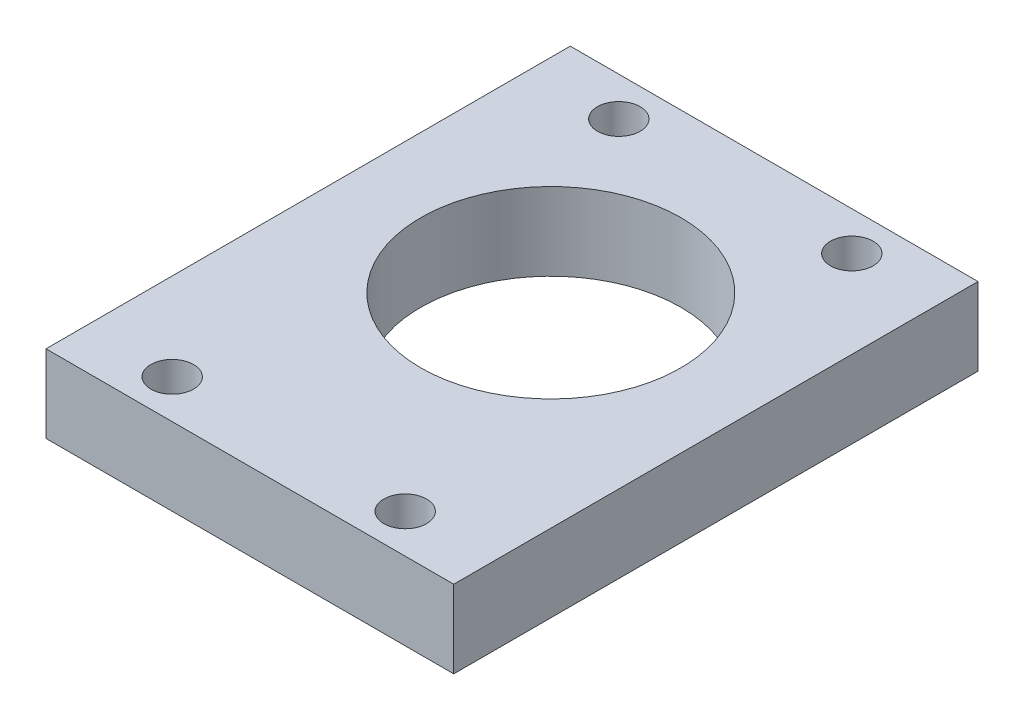
ISO-10303-21;
HEADER;
FILE_DESCRIPTION(('STEP AP214'),'2;1');
FILE_NAME('part.step','',(''),(''),'','','');
FILE_SCHEMA(('AUTOMOTIVE_DESIGN { 1 0 10303 214 1 1 1 1 }'));
ENDSEC;
DATA;
#1=APPLICATION_CONTEXT('core data for automotive mechanical design processes');
#2=APPLICATION_PROTOCOL_DEFINITION('international standard','automotive_design',2000,#1);
#3=PRODUCT_CONTEXT('',#1,'mechanical');
#4=PRODUCT('Part','Part','',(#3));
#5=PRODUCT_RELATED_PRODUCT_CATEGORY('part','',(#4));
#6=PRODUCT_DEFINITION_FORMATION('','',#4);
#7=PRODUCT_DEFINITION_CONTEXT('part definition',#1,'design');
#8=PRODUCT_DEFINITION('design','',#6,#7);
#9=PRODUCT_DEFINITION_SHAPE('','',#8);
#10=(LENGTH_UNIT() NAMED_UNIT(*) SI_UNIT(.MILLI.,.METRE.));
#11=(NAMED_UNIT(*) PLANE_ANGLE_UNIT() SI_UNIT($,.RADIAN.));
#12=(NAMED_UNIT(*) SI_UNIT($,.STERADIAN.) SOLID_ANGLE_UNIT());
#13=UNCERTAINTY_MEASURE_WITH_UNIT(LENGTH_MEASURE(1.E-05),#10,'distance_accuracy_value','');
#14=(GEOMETRIC_REPRESENTATION_CONTEXT(3) GLOBAL_UNCERTAINTY_ASSIGNED_CONTEXT((#13)) GLOBAL_UNIT_ASSIGNED_CONTEXT((#10,
#11,#12)) REPRESENTATION_CONTEXT('',''));
#15=CARTESIAN_POINT('',(0.,0.,0.));
#16=DIRECTION('',(0.,0.,1.));
#17=DIRECTION('',(1.,0.,0.));
#18=AXIS2_PLACEMENT_3D('',#15,#16,#17);
#19=CARTESIAN_POINT('',(0.,8.,0.));
#20=DIRECTION('',(0.,-1.,0.));
#21=DIRECTION('',(0.,0.,-1.));
#22=AXIS2_PLACEMENT_3D('',#19,#20,#21);
#23=PLANE('',#22);
#24=CARTESIAN_POINT('',(9.,8.,-4.));
#25=DIRECTION('',(0.,1.,0.));
#26=DIRECTION('',(0.,0.,-1.));
#27=AXIS2_PLACEMENT_3D('',#24,#25,#26);
#28=CIRCLE('',#27,2.2);
#29=CARTESIAN_POINT('',(9.,8.,-6.2));
#30=VERTEX_POINT('',#29);
#31=EDGE_CURVE('E123',#30,#30,#28,.T.);
#32=ORIENTED_EDGE('',*,*,#31,.F.);
#33=EDGE_LOOP('',(#32));
#34=FACE_BOUND('',#33,.T.);
#35=CARTESIAN_POINT('',(33.,8.,-4.));
#36=DIRECTION('',(0.,1.,0.));
#37=DIRECTION('',(0.,0.,-1.));
#38=AXIS2_PLACEMENT_3D('',#35,#36,#37);
#39=CIRCLE('',#38,2.2);
#40=CARTESIAN_POINT('',(33.,8.,-6.2));
#41=VERTEX_POINT('',#40);
#42=EDGE_CURVE('E129',#41,#41,#39,.T.);
#43=ORIENTED_EDGE('',*,*,#42,.F.);
#44=EDGE_LOOP('',(#43));
#45=FACE_BOUND('',#44,.T.);
#46=CARTESIAN_POINT('',(33.,8.,-50.));
#47=DIRECTION('',(0.,1.,0.));
#48=DIRECTION('',(0.,0.,1.));
#49=AXIS2_PLACEMENT_3D('',#46,#47,#48);
#50=CIRCLE('',#49,2.2);
#51=CARTESIAN_POINT('',(33.,8.,-47.8));
#52=VERTEX_POINT('',#51);
#53=EDGE_CURVE('E135',#52,#52,#50,.T.);
#54=ORIENTED_EDGE('',*,*,#53,.F.);
#55=EDGE_LOOP('',(#54));
#56=FACE_BOUND('',#55,.T.);
#57=CARTESIAN_POINT('',(9.,8.,-50.));
#58=DIRECTION('',(0.,1.,0.));
#59=DIRECTION('',(0.,0.,1.));
#60=AXIS2_PLACEMENT_3D('',#57,#58,#59);
#61=CIRCLE('',#60,2.2);
#62=CARTESIAN_POINT('',(9.,8.,-47.8));
#63=VERTEX_POINT('',#62);
#64=EDGE_CURVE('E117',#63,#63,#61,.T.);
#65=ORIENTED_EDGE('',*,*,#64,.F.);
#66=EDGE_LOOP('',(#65));
#67=FACE_BOUND('',#66,.T.);
#68=DIRECTION('',(0.,0.,-1.));
#69=VECTOR('',#68,1.);
#70=CARTESIAN_POINT('',(42.,8.,0.));
#71=LINE('',#70,#69);
#72=CARTESIAN_POINT('',(42.,8.,0.));
#73=VERTEX_POINT('',#72);
#74=CARTESIAN_POINT('',(42.,8.,-54.));
#75=VERTEX_POINT('',#74);
#76=EDGE_CURVE('E91',#73,#75,#71,.T.);
#77=ORIENTED_EDGE('',*,*,#76,.T.);
#78=DIRECTION('',(1.,0.,0.));
#79=VECTOR('',#78,1.);
#80=CARTESIAN_POINT('',(0.,8.,-54.));
#81=LINE('',#80,#79);
#82=CARTESIAN_POINT('',(0.,8.,-54.));
#83=VERTEX_POINT('',#82);
#84=EDGE_CURVE('E56',#83,#75,#81,.T.);
#85=ORIENTED_EDGE('',*,*,#84,.F.);
#86=DIRECTION('',(0.,0.,1.));
#87=VECTOR('',#86,1.);
#88=CARTESIAN_POINT('',(0.,8.,0.));
#89=LINE('',#88,#87);
#90=CARTESIAN_POINT('',(0.,8.,0.));
#91=VERTEX_POINT('',#90);
#92=EDGE_CURVE('E97',#83,#91,#89,.T.);
#93=ORIENTED_EDGE('',*,*,#92,.T.);
#94=DIRECTION('',(1.,0.,0.));
#95=VECTOR('',#94,1.);
#96=CARTESIAN_POINT('',(0.,8.,0.));
#97=LINE('',#96,#95);
#98=EDGE_CURVE('E65',#91,#73,#97,.T.);
#99=ORIENTED_EDGE('',*,*,#98,.T.);
#100=EDGE_LOOP('',(#77,#85,#93,#99));
#101=FACE_BOUND('',#100,.T.);
#102=CARTESIAN_POINT('',(21.,8.,-31.));
#103=DIRECTION('',(0.,1.,0.));
#104=DIRECTION('',(0.,0.,1.));
#105=AXIS2_PLACEMENT_3D('',#102,#103,#104);
#106=CIRCLE('',#105,13.4);
#107=CARTESIAN_POINT('',(21.,8.,-17.6));
#108=VERTEX_POINT('',#107);
#109=EDGE_CURVE('E102',#108,#108,#106,.T.);
#110=ORIENTED_EDGE('',*,*,#109,.F.);
#111=EDGE_LOOP('',(#110));
#112=FACE_BOUND('',#111,.T.);
#113=ADVANCED_FACE('F41',(#34,#45,#56,#67,#101,#112),#23,.F.);
#114=CARTESIAN_POINT('',(0.,0.,0.));
#115=DIRECTION('',(0.,-1.,0.));
#116=DIRECTION('',(0.,0.,-1.));
#117=AXIS2_PLACEMENT_3D('',#114,#115,#116);
#118=PLANE('',#117);
#119=CARTESIAN_POINT('',(9.,0.,-4.));
#120=DIRECTION('',(0.,1.,0.));
#121=DIRECTION('',(0.,0.,-1.));
#122=AXIS2_PLACEMENT_3D('',#119,#120,#121);
#123=CIRCLE('',#122,2.2);
#124=CARTESIAN_POINT('',(9.,0.,-6.2));
#125=VERTEX_POINT('',#124);
#126=EDGE_CURVE('E126',#125,#125,#123,.T.);
#127=ORIENTED_EDGE('',*,*,#126,.T.);
#128=EDGE_LOOP('',(#127));
#129=FACE_BOUND('',#128,.T.);
#130=CARTESIAN_POINT('',(33.,0.,-4.));
#131=DIRECTION('',(0.,1.,0.));
#132=DIRECTION('',(0.,0.,-1.));
#133=AXIS2_PLACEMENT_3D('',#130,#131,#132);
#134=CIRCLE('',#133,2.2);
#135=CARTESIAN_POINT('',(33.,0.,-6.2));
#136=VERTEX_POINT('',#135);
#137=EDGE_CURVE('E132',#136,#136,#134,.T.);
#138=ORIENTED_EDGE('',*,*,#137,.T.);
#139=EDGE_LOOP('',(#138));
#140=FACE_BOUND('',#139,.T.);
#141=CARTESIAN_POINT('',(33.,0.,-50.));
#142=DIRECTION('',(0.,1.,0.));
#143=DIRECTION('',(0.,0.,1.));
#144=AXIS2_PLACEMENT_3D('',#141,#142,#143);
#145=CIRCLE('',#144,2.2);
#146=CARTESIAN_POINT('',(33.,0.,-47.8));
#147=VERTEX_POINT('',#146);
#148=EDGE_CURVE('E120',#147,#147,#145,.T.);
#149=ORIENTED_EDGE('',*,*,#148,.T.);
#150=EDGE_LOOP('',(#149));
#151=FACE_BOUND('',#150,.T.);
#152=CARTESIAN_POINT('',(9.,0.,-50.));
#153=DIRECTION('',(0.,1.,0.));
#154=DIRECTION('',(0.,0.,1.));
#155=AXIS2_PLACEMENT_3D('',#152,#153,#154);
#156=CIRCLE('',#155,2.2);
#157=CARTESIAN_POINT('',(9.,0.,-47.8));
#158=VERTEX_POINT('',#157);
#159=EDGE_CURVE('E116',#158,#158,#156,.T.);
#160=ORIENTED_EDGE('',*,*,#159,.T.);
#161=EDGE_LOOP('',(#160));
#162=FACE_BOUND('',#161,.T.);
#163=DIRECTION('',(1.,0.,0.));
#164=VECTOR('',#163,1.);
#165=CARTESIAN_POINT('',(0.,0.,-54.));
#166=LINE('',#165,#164);
#167=CARTESIAN_POINT('',(0.,0.,-54.));
#168=VERTEX_POINT('',#167);
#169=CARTESIAN_POINT('',(42.,0.,-54.));
#170=VERTEX_POINT('',#169);
#171=EDGE_CURVE('E96',#168,#170,#166,.T.);
#172=ORIENTED_EDGE('',*,*,#171,.T.);
#173=DIRECTION('',(0.,0.,-1.));
#174=VECTOR('',#173,1.);
#175=CARTESIAN_POINT('',(42.,0.,0.));
#176=LINE('',#175,#174);
#177=CARTESIAN_POINT('',(42.,0.,0.));
#178=VERTEX_POINT('',#177);
#179=EDGE_CURVE('E85',#178,#170,#176,.T.);
#180=ORIENTED_EDGE('',*,*,#179,.F.);
#181=DIRECTION('',(1.,0.,0.));
#182=VECTOR('',#181,1.);
#183=CARTESIAN_POINT('',(0.,0.,0.));
#184=LINE('',#183,#182);
#185=CARTESIAN_POINT('',(0.,0.,0.));
#186=VERTEX_POINT('',#185);
#187=EDGE_CURVE('E77',#186,#178,#184,.T.);
#188=ORIENTED_EDGE('',*,*,#187,.F.);
#189=DIRECTION('',(0.,0.,1.));
#190=VECTOR('',#189,1.);
#191=CARTESIAN_POINT('',(0.,0.,0.));
#192=LINE('',#191,#190);
#193=EDGE_CURVE('E86',#168,#186,#192,.T.);
#194=ORIENTED_EDGE('',*,*,#193,.F.);
#195=EDGE_LOOP('',(#172,#180,#188,#194));
#196=FACE_BOUND('',#195,.T.);
#197=CARTESIAN_POINT('',(21.,0.,-31.));
#198=DIRECTION('',(0.,1.,0.));
#199=DIRECTION('',(0.,0.,1.));
#200=AXIS2_PLACEMENT_3D('',#197,#198,#199);
#201=CIRCLE('',#200,13.4);
#202=CARTESIAN_POINT('',(21.,0.,-17.6));
#203=VERTEX_POINT('',#202);
#204=EDGE_CURVE('E105',#203,#203,#201,.T.);
#205=ORIENTED_EDGE('',*,*,#204,.T.);
#206=EDGE_LOOP('',(#205));
#207=FACE_BOUND('',#206,.T.);
#208=ADVANCED_FACE('F93',(#129,#140,#151,#162,#196,#207),#118,.T.);
#209=CARTESIAN_POINT('',(0.,8.,0.));
#210=DIRECTION('',(1.,0.,0.));
#211=DIRECTION('',(0.,0.,-1.));
#212=AXIS2_PLACEMENT_3D('',#209,#210,#211);
#213=PLANE('',#212);
#214=ORIENTED_EDGE('',*,*,#92,.F.);
#215=DIRECTION('',(0.,1.,0.));
#216=VECTOR('',#215,1.);
#217=CARTESIAN_POINT('',(0.,-0.000999999999999265,-54.));
#218=LINE('',#217,#216);
#219=EDGE_CURVE('E112',#168,#83,#218,.T.);
#220=ORIENTED_EDGE('',*,*,#219,.F.);
#221=ORIENTED_EDGE('',*,*,#193,.T.);
#222=DIRECTION('',(0.,-1.,0.));
#223=VECTOR('',#222,1.);
#224=CARTESIAN_POINT('',(0.,8.,0.));
#225=LINE('',#224,#223);
#226=EDGE_CURVE('E11',#91,#186,#225,.T.);
#227=ORIENTED_EDGE('',*,*,#226,.F.);
#228=EDGE_LOOP('',(#214,#220,#221,#227));
#229=FACE_BOUND('',#228,.T.);
#230=ADVANCED_FACE('F43',(#229),#213,.F.);
#231=CARTESIAN_POINT('',(0.,8.,0.));
#232=DIRECTION('',(0.,0.,-1.));
#233=DIRECTION('',(-1.,0.,0.));
#234=AXIS2_PLACEMENT_3D('',#231,#232,#233);
#235=PLANE('',#234);
#236=ORIENTED_EDGE('',*,*,#187,.T.);
#237=DIRECTION('',(0.,-1.,0.));
#238=VECTOR('',#237,1.);
#239=CARTESIAN_POINT('',(42.,8.,0.));
#240=LINE('',#239,#238);
#241=EDGE_CURVE('E49',#73,#178,#240,.T.);
#242=ORIENTED_EDGE('',*,*,#241,.F.);
#243=ORIENTED_EDGE('',*,*,#98,.F.);
#244=ORIENTED_EDGE('',*,*,#226,.T.);
#245=EDGE_LOOP('',(#236,#242,#243,#244));
#246=FACE_BOUND('',#245,.T.);
#247=ADVANCED_FACE('F79',(#246),#235,.F.);
#248=CARTESIAN_POINT('',(42.,8.,0.));
#249=DIRECTION('',(-1.,0.,0.));
#250=DIRECTION('',(0.,0.,1.));
#251=AXIS2_PLACEMENT_3D('',#248,#249,#250);
#252=PLANE('',#251);
#253=ORIENTED_EDGE('',*,*,#179,.T.);
#254=DIRECTION('',(0.,1.,0.));
#255=VECTOR('',#254,1.);
#256=CARTESIAN_POINT('',(42.,-0.000999999999999265,-54.));
#257=LINE('',#256,#255);
#258=EDGE_CURVE('E111',#170,#75,#257,.T.);
#259=ORIENTED_EDGE('',*,*,#258,.T.);
#260=ORIENTED_EDGE('',*,*,#76,.F.);
#261=ORIENTED_EDGE('',*,*,#241,.T.);
#262=EDGE_LOOP('',(#253,#259,#260,#261));
#263=FACE_BOUND('',#262,.T.);
#264=ADVANCED_FACE('F90',(#263),#252,.F.);
#265=CARTESIAN_POINT('',(21.,8.,-31.));
#266=DIRECTION('',(0.,-1.,0.));
#267=DIRECTION('',(0.,0.,-1.));
#268=AXIS2_PLACEMENT_3D('',#265,#266,#267);
#269=CYLINDRICAL_SURFACE('',#268,13.4);
#270=ORIENTED_EDGE('',*,*,#109,.T.);
#271=EDGE_LOOP('',(#270));
#272=FACE_BOUND('',#271,.T.);
#273=ORIENTED_EDGE('',*,*,#204,.F.);
#274=EDGE_LOOP('',(#273));
#275=FACE_BOUND('',#274,.T.);
#276=ADVANCED_FACE('F159',(#272,#275),#269,.F.);
#277=CARTESIAN_POINT('',(0.,-0.000999999999999265,-54.));
#278=DIRECTION('',(0.,0.,1.));
#279=DIRECTION('',(1.,0.,0.));
#280=AXIS2_PLACEMENT_3D('',#277,#278,#279);
#281=PLANE('',#280);
#282=ORIENTED_EDGE('',*,*,#219,.T.);
#283=ORIENTED_EDGE('',*,*,#84,.T.);
#284=ORIENTED_EDGE('',*,*,#258,.F.);
#285=ORIENTED_EDGE('',*,*,#171,.F.);
#286=EDGE_LOOP('',(#282,#283,#284,#285));
#287=FACE_BOUND('',#286,.T.);
#288=ADVANCED_FACE('F162',(#287),#281,.F.);
#289=CARTESIAN_POINT('',(9.,0.,-50.));
#290=DIRECTION('',(0.,1.,0.));
#291=DIRECTION('',(0.,0.,1.));
#292=AXIS2_PLACEMENT_3D('',#289,#290,#291);
#293=CYLINDRICAL_SURFACE('',#292,2.2);
#294=ORIENTED_EDGE('',*,*,#159,.F.);
#295=EDGE_LOOP('',(#294));
#296=FACE_BOUND('',#295,.T.);
#297=ORIENTED_EDGE('',*,*,#64,.T.);
#298=EDGE_LOOP('',(#297));
#299=FACE_BOUND('',#298,.T.);
#300=ADVANCED_FACE('F147',(#296,#299),#293,.F.);
#301=CARTESIAN_POINT('',(33.,0.,-50.));
#302=DIRECTION('',(0.,1.,0.));
#303=DIRECTION('',(0.,0.,1.));
#304=AXIS2_PLACEMENT_3D('',#301,#302,#303);
#305=CYLINDRICAL_SURFACE('',#304,2.2);
#306=ORIENTED_EDGE('',*,*,#148,.F.);
#307=EDGE_LOOP('',(#306));
#308=FACE_BOUND('',#307,.T.);
#309=ORIENTED_EDGE('',*,*,#53,.T.);
#310=EDGE_LOOP('',(#309));
#311=FACE_BOUND('',#310,.T.);
#312=ADVANCED_FACE('F143',(#308,#311),#305,.F.);
#313=CARTESIAN_POINT('',(33.,0.,-4.));
#314=DIRECTION('',(0.,1.,0.));
#315=DIRECTION('',(0.,0.,1.));
#316=AXIS2_PLACEMENT_3D('',#313,#314,#315);
#317=CYLINDRICAL_SURFACE('',#316,2.2);
#318=ORIENTED_EDGE('',*,*,#137,.F.);
#319=EDGE_LOOP('',(#318));
#320=FACE_BOUND('',#319,.T.);
#321=ORIENTED_EDGE('',*,*,#42,.T.);
#322=EDGE_LOOP('',(#321));
#323=FACE_BOUND('',#322,.T.);
#324=ADVANCED_FACE('F146',(#320,#323),#317,.F.);
#325=CARTESIAN_POINT('',(9.,0.,-4.));
#326=DIRECTION('',(0.,1.,0.));
#327=DIRECTION('',(0.,0.,1.));
#328=AXIS2_PLACEMENT_3D('',#325,#326,#327);
#329=CYLINDRICAL_SURFACE('',#328,2.2);
#330=ORIENTED_EDGE('',*,*,#126,.F.);
#331=EDGE_LOOP('',(#330));
#332=FACE_BOUND('',#331,.T.);
#333=ORIENTED_EDGE('',*,*,#31,.T.);
#334=EDGE_LOOP('',(#333));
#335=FACE_BOUND('',#334,.T.);
#336=ADVANCED_FACE('F227',(#332,#335),#329,.F.);
#337=CLOSED_SHELL('',(#113,#208,#230,#247,#264,#276,#288,#300,#312,#324,#336));
#338=MANIFOLD_SOLID_BREP('B2',#337);
#339=ADVANCED_BREP_SHAPE_REPRESENTATION('',(#18,#338),#14);
#340=SHAPE_DEFINITION_REPRESENTATION(#9,#339);
ENDSEC;
END-ISO-10303-21;
